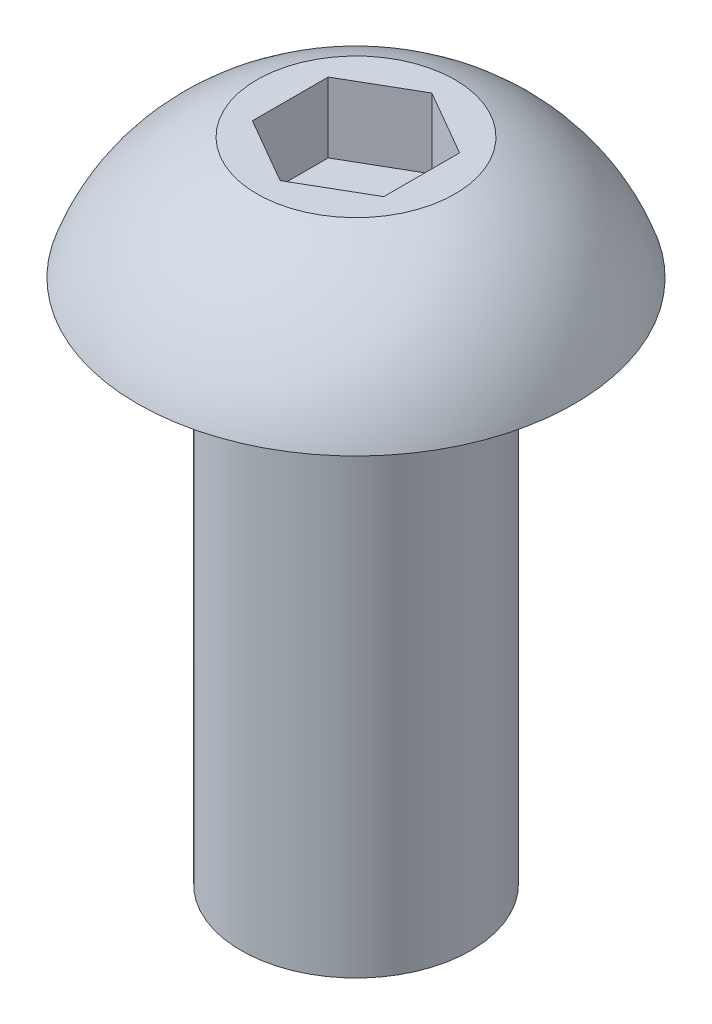
ISO-10303-21;
HEADER;
FILE_DESCRIPTION(('STEP AP214'),'2;1');
FILE_NAME('part.step','',(''),(''),'','','');
FILE_SCHEMA(('AUTOMOTIVE_DESIGN { 1 0 10303 214 1 1 1 1 }'));
ENDSEC;
DATA;
#1=APPLICATION_CONTEXT('core data for automotive mechanical design processes');
#2=APPLICATION_PROTOCOL_DEFINITION('international standard','automotive_design',2000,#1);
#3=PRODUCT_CONTEXT('',#1,'mechanical');
#4=PRODUCT('Part','Part','',(#3));
#5=PRODUCT_RELATED_PRODUCT_CATEGORY('part','',(#4));
#6=PRODUCT_DEFINITION_FORMATION('','',#4);
#7=PRODUCT_DEFINITION_CONTEXT('part definition',#1,'design');
#8=PRODUCT_DEFINITION('design','',#6,#7);
#9=PRODUCT_DEFINITION_SHAPE('','',#8);
#10=(LENGTH_UNIT() NAMED_UNIT(*) SI_UNIT(.MILLI.,.METRE.));
#11=(NAMED_UNIT(*) PLANE_ANGLE_UNIT() SI_UNIT($,.RADIAN.));
#12=(NAMED_UNIT(*) SI_UNIT($,.STERADIAN.) SOLID_ANGLE_UNIT());
#13=UNCERTAINTY_MEASURE_WITH_UNIT(LENGTH_MEASURE(1.E-05),#10,'distance_accuracy_value','');
#14=(GEOMETRIC_REPRESENTATION_CONTEXT(3) GLOBAL_UNCERTAINTY_ASSIGNED_CONTEXT((#13)) GLOBAL_UNIT_ASSIGNED_CONTEXT((#10,
#11,#12)) REPRESENTATION_CONTEXT('',''));
#15=CARTESIAN_POINT('',(0.,0.,0.));
#16=DIRECTION('',(0.,0.,1.));
#17=DIRECTION('',(1.,0.,0.));
#18=AXIS2_PLACEMENT_3D('',#15,#16,#17);
#19=CARTESIAN_POINT('',(0.,-9.525,0.));
#20=DIRECTION('',(0.,-1.,0.));
#21=DIRECTION('',(0.,0.,-1.));
#22=AXIS2_PLACEMENT_3D('',#19,#20,#21);
#23=CYLINDRICAL_SURFACE('',#22,2.0828);
#24=CARTESIAN_POINT('',(0.,-9.525,0.));
#25=DIRECTION('',(0.,-1.,0.));
#26=DIRECTION('',(0.,0.,-1.));
#27=AXIS2_PLACEMENT_3D('',#24,#25,#26);
#28=CIRCLE('',#27,2.0828);
#29=CARTESIAN_POINT('',(0.,-9.525,-2.0828));
#30=VERTEX_POINT('',#29);
#31=EDGE_CURVE('E133',#30,#30,#28,.T.);
#32=ORIENTED_EDGE('',*,*,#31,.F.);
#33=EDGE_LOOP('',(#32));
#34=FACE_BOUND('',#33,.T.);
#35=CARTESIAN_POINT('',(0.,0.,0.));
#36=DIRECTION('',(0.,-1.,0.));
#37=DIRECTION('',(0.,0.,-1.));
#38=AXIS2_PLACEMENT_3D('',#35,#36,#37);
#39=CIRCLE('',#38,2.0828);
#40=CARTESIAN_POINT('',(0.,0.,-2.0828));
#41=VERTEX_POINT('',#40);
#42=EDGE_CURVE('E11',#41,#41,#39,.T.);
#43=ORIENTED_EDGE('',*,*,#42,.T.);
#44=EDGE_LOOP('',(#43));
#45=FACE_BOUND('',#44,.T.);
#46=ADVANCED_FACE('F32',(#34,#45),#23,.T.);
#47=CARTESIAN_POINT('',(-2.0828,0.,0.));
#48=DIRECTION('',(0.,1.,0.));
#49=DIRECTION('',(0.,0.,1.));
#50=AXIS2_PLACEMENT_3D('',#47,#48,#49);
#51=PLANE('',#50);
#52=ORIENTED_EDGE('',*,*,#42,.F.);
#53=EDGE_LOOP('',(#52));
#54=FACE_BOUND('',#53,.T.);
#55=CARTESIAN_POINT('',(0.,0.,0.));
#56=DIRECTION('',(0.,-1.,0.));
#57=DIRECTION('',(0.,0.,-1.));
#58=AXIS2_PLACEMENT_3D('',#55,#56,#57);
#59=CIRCLE('',#58,3.9624);
#60=CARTESIAN_POINT('',(0.,0.,-3.9624));
#61=VERTEX_POINT('',#60);
#62=EDGE_CURVE('E39',#61,#61,#59,.T.);
#63=ORIENTED_EDGE('',*,*,#62,.T.);
#64=EDGE_LOOP('',(#63));
#65=FACE_BOUND('',#64,.T.);
#66=ADVANCED_FACE('F146',(#54,#65),#51,.F.);
#67=CARTESIAN_POINT('',(0.,-1.14110107621728,0.));
#68=DIRECTION('',(0.,-1.,0.));
#69=DIRECTION('',(0.,0.,-1.));
#70=AXIS2_PLACEMENT_3D('',#67,#68,#69);
#71=DEGENERATE_TOROIDAL_SURFACE('',#70,0.588889242879197,3.5612759643917,.T.);
#72=ORIENTED_EDGE('',*,*,#62,.F.);
#73=EDGE_LOOP('',(#72));
#74=FACE_BOUND('',#73,.T.);
#75=CARTESIAN_POINT('',(0.,2.2098,0.));
#76=DIRECTION('',(0.,-1.,0.));
#77=DIRECTION('',(0.,0.,-1.));
#78=AXIS2_PLACEMENT_3D('',#75,#76,#77);
#79=CIRCLE('',#78,1.7947700296736);
#80=CARTESIAN_POINT('',(0.,2.2098,-1.7947700296736));
#81=VERTEX_POINT('',#80);
#82=EDGE_CURVE('E141',#81,#81,#79,.T.);
#83=ORIENTED_EDGE('',*,*,#82,.T.);
#84=EDGE_LOOP('',(#83));
#85=FACE_BOUND('',#84,.T.);
#86=ADVANCED_FACE('F148',(#74,#85),#71,.T.);
#87=CARTESIAN_POINT('',(0.,2.2098,0.));
#88=DIRECTION('',(0.,-1.,0.));
#89=DIRECTION('',(0.,0.,-1.));
#90=AXIS2_PLACEMENT_3D('',#87,#88,#89);
#91=PLANE('',#90);
#92=DIRECTION('',(0.,0.,1.));
#93=VECTOR('',#92,1.);
#94=CARTESIAN_POINT('',(-1.190625,2.2098,-0.687407664253898));
#95=LINE('',#94,#93);
#96=CARTESIAN_POINT('',(-1.190625,2.2098,-0.687407664253898));
#97=VERTEX_POINT('',#96);
#98=CARTESIAN_POINT('',(-1.190625,2.2098,0.687407664253898));
#99=VERTEX_POINT('',#98);
#100=EDGE_CURVE('E120',#97,#99,#95,.T.);
#101=ORIENTED_EDGE('',*,*,#100,.F.);
#102=DIRECTION('',(-0.866025403784439,0.,0.5));
#103=VECTOR('',#102,1.);
#104=CARTESIAN_POINT('',(0.,2.2098,-1.3748153285078));
#105=LINE('',#104,#103);
#106=CARTESIAN_POINT('',(0.,2.2098,-1.3748153285078));
#107=VERTEX_POINT('',#106);
#108=EDGE_CURVE('E46',#107,#97,#105,.T.);
#109=ORIENTED_EDGE('',*,*,#108,.F.);
#110=DIRECTION('',(-0.866025403784439,0.,-0.5));
#111=VECTOR('',#110,1.);
#112=CARTESIAN_POINT('',(1.190625,2.2098,-0.687407664253898));
#113=LINE('',#112,#111);
#114=CARTESIAN_POINT('',(1.190625,2.2098,-0.687407664253898));
#115=VERTEX_POINT('',#114);
#116=EDGE_CURVE('E129',#115,#107,#113,.T.);
#117=ORIENTED_EDGE('',*,*,#116,.F.);
#118=DIRECTION('',(0.,0.,-1.));
#119=VECTOR('',#118,1.);
#120=CARTESIAN_POINT('',(1.190625,2.2098,0.687407664253898));
#121=LINE('',#120,#119);
#122=CARTESIAN_POINT('',(1.190625,2.2098,0.687407664253898));
#123=VERTEX_POINT('',#122);
#124=EDGE_CURVE('E127',#123,#115,#121,.T.);
#125=ORIENTED_EDGE('',*,*,#124,.F.);
#126=DIRECTION('',(0.866025403784438,0.,-0.5));
#127=VECTOR('',#126,1.);
#128=CARTESIAN_POINT('',(0.,2.2098,1.3748153285078));
#129=LINE('',#128,#127);
#130=CARTESIAN_POINT('',(0.,2.2098,1.3748153285078));
#131=VERTEX_POINT('',#130);
#132=EDGE_CURVE('E94',#131,#123,#129,.T.);
#133=ORIENTED_EDGE('',*,*,#132,.F.);
#134=DIRECTION('',(0.866025403784439,0.,0.5));
#135=VECTOR('',#134,1.);
#136=CARTESIAN_POINT('',(-1.190625,2.2098,0.687407664253898));
#137=LINE('',#136,#135);
#138=EDGE_CURVE('E123',#99,#131,#137,.T.);
#139=ORIENTED_EDGE('',*,*,#138,.F.);
#140=EDGE_LOOP('',(#101,#109,#117,#125,#133,#139));
#141=FACE_BOUND('',#140,.T.);
#142=ORIENTED_EDGE('',*,*,#82,.F.);
#143=EDGE_LOOP('',(#142));
#144=FACE_BOUND('',#143,.T.);
#145=ADVANCED_FACE('F151',(#141,#144),#91,.F.);
#146=CARTESIAN_POINT('',(-2.0828,-9.525,0.));
#147=DIRECTION('',(0.,1.,0.));
#148=DIRECTION('',(0.,0.,1.));
#149=AXIS2_PLACEMENT_3D('',#146,#147,#148);
#150=PLANE('',#149);
#151=ORIENTED_EDGE('',*,*,#31,.T.);
#152=EDGE_LOOP('',(#151));
#153=FACE_BOUND('',#152,.T.);
#154=ADVANCED_FACE('F156',(#153),#150,.F.);
#155=CARTESIAN_POINT('',(0.,0.939799999999999,-1.3748153285078));
#156=DIRECTION('',(-0.5,0.,-0.866025403784439));
#157=DIRECTION('',(-0.866025403784439,0.,0.5));
#158=AXIS2_PLACEMENT_3D('',#155,#156,#157);
#159=PLANE('',#158);
#160=ORIENTED_EDGE('',*,*,#108,.T.);
#161=DIRECTION('',(0.,1.,0.));
#162=VECTOR('',#161,1.);
#163=CARTESIAN_POINT('',(-1.190625,0.939799999999999,-0.687407664253898));
#164=LINE('',#163,#162);
#165=CARTESIAN_POINT('',(-1.190625,0.939799999999999,-0.687407664253898));
#166=VERTEX_POINT('',#165);
#167=EDGE_CURVE('E76',#166,#97,#164,.T.);
#168=ORIENTED_EDGE('',*,*,#167,.F.);
#169=DIRECTION('',(-0.866025403784439,0.,0.5));
#170=VECTOR('',#169,1.);
#171=CARTESIAN_POINT('',(0.,0.939799999999999,-1.3748153285078));
#172=LINE('',#171,#170);
#173=CARTESIAN_POINT('',(0.,0.939799999999999,-1.3748153285078));
#174=VERTEX_POINT('',#173);
#175=EDGE_CURVE('E131',#174,#166,#172,.T.);
#176=ORIENTED_EDGE('',*,*,#175,.F.);
#177=DIRECTION('',(0.,1.,0.));
#178=VECTOR('',#177,1.);
#179=CARTESIAN_POINT('',(0.,0.939799999999999,-1.3748153285078));
#180=LINE('',#179,#178);
#181=EDGE_CURVE('E54',#174,#107,#180,.T.);
#182=ORIENTED_EDGE('',*,*,#181,.T.);
#183=EDGE_LOOP('',(#160,#168,#176,#182));
#184=FACE_BOUND('',#183,.T.);
#185=ADVANCED_FACE('F162',(#184),#159,.F.);
#186=CARTESIAN_POINT('',(1.190625,0.939799999999999,-0.687407664253898));
#187=DIRECTION('',(0.5,0.,-0.866025403784439));
#188=DIRECTION('',(-0.866025403784439,0.,-0.5));
#189=AXIS2_PLACEMENT_3D('',#186,#187,#188);
#190=PLANE('',#189);
#191=ORIENTED_EDGE('',*,*,#116,.T.);
#192=ORIENTED_EDGE('',*,*,#181,.F.);
#193=DIRECTION('',(-0.866025403784439,0.,-0.5));
#194=VECTOR('',#193,1.);
#195=CARTESIAN_POINT('',(1.190625,0.939799999999999,-0.687407664253898));
#196=LINE('',#195,#194);
#197=CARTESIAN_POINT('',(1.190625,0.939799999999999,-0.687407664253898));
#198=VERTEX_POINT('',#197);
#199=EDGE_CURVE('E106',#198,#174,#196,.T.);
#200=ORIENTED_EDGE('',*,*,#199,.F.);
#201=DIRECTION('',(0.,1.,0.));
#202=VECTOR('',#201,1.);
#203=CARTESIAN_POINT('',(1.190625,0.939799999999999,-0.687407664253898));
#204=LINE('',#203,#202);
#205=EDGE_CURVE('E98',#198,#115,#204,.T.);
#206=ORIENTED_EDGE('',*,*,#205,.T.);
#207=EDGE_LOOP('',(#191,#192,#200,#206));
#208=FACE_BOUND('',#207,.T.);
#209=ADVANCED_FACE('F200',(#208),#190,.F.);
#210=CARTESIAN_POINT('',(1.190625,0.939799999999999,0.687407664253898));
#211=DIRECTION('',(1.,0.,0.));
#212=DIRECTION('',(0.,0.,-1.));
#213=AXIS2_PLACEMENT_3D('',#210,#211,#212);
#214=PLANE('',#213);
#215=ORIENTED_EDGE('',*,*,#124,.T.);
#216=ORIENTED_EDGE('',*,*,#205,.F.);
#217=DIRECTION('',(0.,0.,-1.));
#218=VECTOR('',#217,1.);
#219=CARTESIAN_POINT('',(1.190625,0.939799999999999,0.687407664253898));
#220=LINE('',#219,#218);
#221=CARTESIAN_POINT('',(1.190625,0.939799999999999,0.687407664253898));
#222=VERTEX_POINT('',#221);
#223=EDGE_CURVE('E102',#222,#198,#220,.T.);
#224=ORIENTED_EDGE('',*,*,#223,.F.);
#225=DIRECTION('',(0.,1.,0.));
#226=VECTOR('',#225,1.);
#227=CARTESIAN_POINT('',(1.190625,0.939799999999999,0.687407664253898));
#228=LINE('',#227,#226);
#229=EDGE_CURVE('E87',#222,#123,#228,.T.);
#230=ORIENTED_EDGE('',*,*,#229,.T.);
#231=EDGE_LOOP('',(#215,#216,#224,#230));
#232=FACE_BOUND('',#231,.T.);
#233=ADVANCED_FACE('F103',(#232),#214,.F.);
#234=CARTESIAN_POINT('',(0.,0.939799999999999,1.3748153285078));
#235=DIRECTION('',(0.5,0.,0.866025403784438));
#236=DIRECTION('',(0.866025403784439,0.,-0.5));
#237=AXIS2_PLACEMENT_3D('',#234,#235,#236);
#238=PLANE('',#237);
#239=ORIENTED_EDGE('',*,*,#132,.T.);
#240=ORIENTED_EDGE('',*,*,#229,.F.);
#241=DIRECTION('',(0.866025403784438,0.,-0.5));
#242=VECTOR('',#241,1.);
#243=CARTESIAN_POINT('',(0.,0.939799999999999,1.3748153285078));
#244=LINE('',#243,#242);
#245=CARTESIAN_POINT('',(0.,0.939799999999999,1.3748153285078));
#246=VERTEX_POINT('',#245);
#247=EDGE_CURVE('E91',#246,#222,#244,.T.);
#248=ORIENTED_EDGE('',*,*,#247,.F.);
#249=DIRECTION('',(0.,1.,0.));
#250=VECTOR('',#249,1.);
#251=CARTESIAN_POINT('',(0.,0.939799999999999,1.3748153285078));
#252=LINE('',#251,#250);
#253=EDGE_CURVE('E99',#246,#131,#252,.T.);
#254=ORIENTED_EDGE('',*,*,#253,.T.);
#255=EDGE_LOOP('',(#239,#240,#248,#254));
#256=FACE_BOUND('',#255,.T.);
#257=ADVANCED_FACE('F89',(#256),#238,.F.);
#258=CARTESIAN_POINT('',(-1.190625,0.939799999999999,0.687407664253898));
#259=DIRECTION('',(-0.5,0.,0.866025403784439));
#260=DIRECTION('',(0.866025403784439,0.,0.5));
#261=AXIS2_PLACEMENT_3D('',#258,#259,#260);
#262=PLANE('',#261);
#263=ORIENTED_EDGE('',*,*,#138,.T.);
#264=ORIENTED_EDGE('',*,*,#253,.F.);
#265=DIRECTION('',(0.866025403784439,0.,0.5));
#266=VECTOR('',#265,1.);
#267=CARTESIAN_POINT('',(-1.190625,0.939799999999999,0.687407664253898));
#268=LINE('',#267,#266);
#269=CARTESIAN_POINT('',(-1.190625,0.939799999999999,0.687407664253898));
#270=VERTEX_POINT('',#269);
#271=EDGE_CURVE('E112',#270,#246,#268,.T.);
#272=ORIENTED_EDGE('',*,*,#271,.F.);
#273=DIRECTION('',(0.,1.,0.));
#274=VECTOR('',#273,1.);
#275=CARTESIAN_POINT('',(-1.190625,0.939799999999999,0.687407664253898));
#276=LINE('',#275,#274);
#277=EDGE_CURVE('E136',#270,#99,#276,.T.);
#278=ORIENTED_EDGE('',*,*,#277,.T.);
#279=EDGE_LOOP('',(#263,#264,#272,#278));
#280=FACE_BOUND('',#279,.T.);
#281=ADVANCED_FACE('F225',(#280),#262,.F.);
#282=CARTESIAN_POINT('',(-1.190625,0.939799999999999,-0.687407664253898));
#283=DIRECTION('',(-1.,0.,0.));
#284=DIRECTION('',(0.,0.,1.));
#285=AXIS2_PLACEMENT_3D('',#282,#283,#284);
#286=PLANE('',#285);
#287=ORIENTED_EDGE('',*,*,#100,.T.);
#288=ORIENTED_EDGE('',*,*,#277,.F.);
#289=DIRECTION('',(0.,0.,1.));
#290=VECTOR('',#289,1.);
#291=CARTESIAN_POINT('',(-1.190625,0.939799999999999,-0.687407664253898));
#292=LINE('',#291,#290);
#293=EDGE_CURVE('E114',#166,#270,#292,.T.);
#294=ORIENTED_EDGE('',*,*,#293,.F.);
#295=ORIENTED_EDGE('',*,*,#167,.T.);
#296=EDGE_LOOP('',(#287,#288,#294,#295));
#297=FACE_BOUND('',#296,.T.);
#298=ADVANCED_FACE('F234',(#297),#286,.F.);
#299=CARTESIAN_POINT('',(0.,0.939799999999999,0.));
#300=DIRECTION('',(0.,1.,0.));
#301=DIRECTION('',(0.,0.,1.));
#302=AXIS2_PLACEMENT_3D('',#299,#300,#301);
#303=PLANE('',#302);
#304=ORIENTED_EDGE('',*,*,#175,.T.);
#305=ORIENTED_EDGE('',*,*,#293,.T.);
#306=ORIENTED_EDGE('',*,*,#271,.T.);
#307=ORIENTED_EDGE('',*,*,#247,.T.);
#308=ORIENTED_EDGE('',*,*,#223,.T.);
#309=ORIENTED_EDGE('',*,*,#199,.T.);
#310=EDGE_LOOP('',(#304,#305,#306,#307,#308,#309));
#311=FACE_BOUND('',#310,.T.);
#312=ADVANCED_FACE('F109',(#311),#303,.T.);
#313=CLOSED_SHELL('',(#46,#66,#86,#145,#154,#185,#209,#233,#257,#281,#298,#312));
#314=MANIFOLD_SOLID_BREP('B2',#313);
#315=ADVANCED_BREP_SHAPE_REPRESENTATION('',(#18,#314),#14);
#316=SHAPE_DEFINITION_REPRESENTATION(#9,#315);
ENDSEC;
END-ISO-10303-21;
